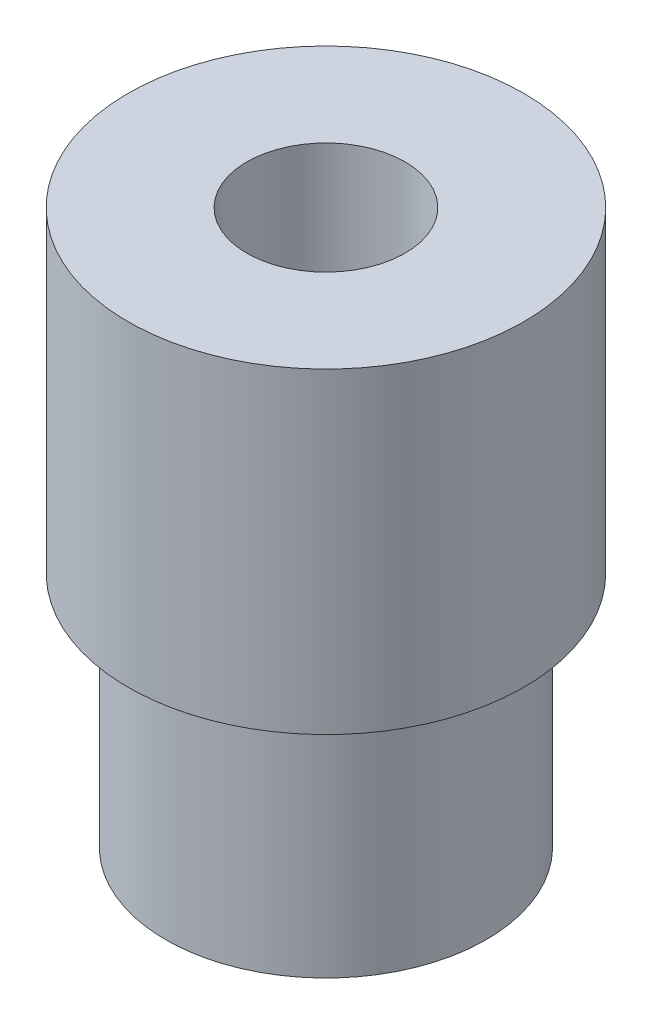
ISO-10303-21;
HEADER;
FILE_DESCRIPTION(('STEP AP214'),'2;1');
FILE_NAME('part.step','',(''),(''),'','','');
FILE_SCHEMA(('AUTOMOTIVE_DESIGN { 1 0 10303 214 1 1 1 1 }'));
ENDSEC;
DATA;
#1=APPLICATION_CONTEXT('core data for automotive mechanical design processes');
#2=APPLICATION_PROTOCOL_DEFINITION('international standard','automotive_design',2000,#1);
#3=PRODUCT_CONTEXT('',#1,'mechanical');
#4=PRODUCT('Part','Part','',(#3));
#5=PRODUCT_RELATED_PRODUCT_CATEGORY('part','',(#4));
#6=PRODUCT_DEFINITION_FORMATION('','',#4);
#7=PRODUCT_DEFINITION_CONTEXT('part definition',#1,'design');
#8=PRODUCT_DEFINITION('design','',#6,#7);
#9=PRODUCT_DEFINITION_SHAPE('','',#8);
#10=(LENGTH_UNIT() NAMED_UNIT(*) SI_UNIT(.MILLI.,.METRE.));
#11=(NAMED_UNIT(*) PLANE_ANGLE_UNIT() SI_UNIT($,.RADIAN.));
#12=(NAMED_UNIT(*) SI_UNIT($,.STERADIAN.) SOLID_ANGLE_UNIT());
#13=UNCERTAINTY_MEASURE_WITH_UNIT(LENGTH_MEASURE(1.E-05),#10,'distance_accuracy_value','');
#14=(GEOMETRIC_REPRESENTATION_CONTEXT(3) GLOBAL_UNCERTAINTY_ASSIGNED_CONTEXT((#13)) GLOBAL_UNIT_ASSIGNED_CONTEXT((#10,
#11,#12)) REPRESENTATION_CONTEXT('',''));
#15=CARTESIAN_POINT('',(0.,0.,0.));
#16=DIRECTION('',(0.,0.,1.));
#17=DIRECTION('',(1.,0.,0.));
#18=AXIS2_PLACEMENT_3D('',#15,#16,#17);
#19=CARTESIAN_POINT('',(0.,0.,0.));
#20=DIRECTION('',(0.,-1.,0.));
#21=DIRECTION('',(0.,0.,-1.));
#22=AXIS2_PLACEMENT_3D('',#19,#20,#21);
#23=CYLINDRICAL_SURFACE('',#22,5.);
#24=CARTESIAN_POINT('',(0.,14.,0.));
#25=DIRECTION('',(0.,-1.,0.));
#26=DIRECTION('',(0.,0.,-1.));
#27=AXIS2_PLACEMENT_3D('',#24,#25,#26);
#28=CIRCLE('',#27,5.);
#29=CARTESIAN_POINT('',(0.,14.,-5.));
#30=VERTEX_POINT('',#29);
#31=EDGE_CURVE('E52',#30,#30,#28,.T.);
#32=ORIENTED_EDGE('',*,*,#31,.T.);
#33=EDGE_LOOP('',(#32));
#34=FACE_BOUND('',#33,.T.);
#35=CARTESIAN_POINT('',(0.,6.,0.));
#36=DIRECTION('',(0.,-1.,0.));
#37=DIRECTION('',(0.,0.,-1.));
#38=AXIS2_PLACEMENT_3D('',#35,#36,#37);
#39=CIRCLE('',#38,5.);
#40=CARTESIAN_POINT('',(0.,6.,-5.));
#41=VERTEX_POINT('',#40);
#42=EDGE_CURVE('E10',#41,#41,#39,.T.);
#43=ORIENTED_EDGE('',*,*,#42,.F.);
#44=EDGE_LOOP('',(#43));
#45=FACE_BOUND('',#44,.T.);
#46=ADVANCED_FACE('F30',(#34,#45),#23,.T.);
#47=CARTESIAN_POINT('',(5.,6.,0.));
#48=DIRECTION('',(0.,-1.,0.));
#49=DIRECTION('',(0.,0.,-1.));
#50=AXIS2_PLACEMENT_3D('',#47,#48,#49);
#51=PLANE('',#50);
#52=ORIENTED_EDGE('',*,*,#42,.T.);
#53=EDGE_LOOP('',(#52));
#54=FACE_BOUND('',#53,.T.);
#55=CARTESIAN_POINT('',(0.,6.,0.));
#56=DIRECTION('',(0.,-1.,0.));
#57=DIRECTION('',(0.,0.,-1.));
#58=AXIS2_PLACEMENT_3D('',#55,#56,#57);
#59=CIRCLE('',#58,4.05);
#60=CARTESIAN_POINT('',(0.,6.,-4.05));
#61=VERTEX_POINT('',#60);
#62=EDGE_CURVE('E36',#61,#61,#59,.T.);
#63=ORIENTED_EDGE('',*,*,#62,.F.);
#64=EDGE_LOOP('',(#63));
#65=FACE_BOUND('',#64,.T.);
#66=ADVANCED_FACE('F70',(#54,#65),#51,.T.);
#67=CARTESIAN_POINT('',(0.,0.,0.));
#68=DIRECTION('',(0.,-1.,0.));
#69=DIRECTION('',(0.,0.,-1.));
#70=AXIS2_PLACEMENT_3D('',#67,#68,#69);
#71=CYLINDRICAL_SURFACE('',#70,4.05);
#72=ORIENTED_EDGE('',*,*,#62,.T.);
#73=EDGE_LOOP('',(#72));
#74=FACE_BOUND('',#73,.T.);
#75=CARTESIAN_POINT('',(0.,0.,0.));
#76=DIRECTION('',(0.,-1.,0.));
#77=DIRECTION('',(0.,0.,-1.));
#78=AXIS2_PLACEMENT_3D('',#75,#76,#77);
#79=CIRCLE('',#78,4.05);
#80=CARTESIAN_POINT('',(0.,0.,-4.05));
#81=VERTEX_POINT('',#80);
#82=EDGE_CURVE('E40',#81,#81,#79,.T.);
#83=ORIENTED_EDGE('',*,*,#82,.F.);
#84=EDGE_LOOP('',(#83));
#85=FACE_BOUND('',#84,.T.);
#86=ADVANCED_FACE('F74',(#74,#85),#71,.T.);
#87=CARTESIAN_POINT('',(4.05,0.,0.));
#88=DIRECTION('',(0.,-1.,0.));
#89=DIRECTION('',(0.,0.,-1.));
#90=AXIS2_PLACEMENT_3D('',#87,#88,#89);
#91=PLANE('',#90);
#92=ORIENTED_EDGE('',*,*,#82,.T.);
#93=EDGE_LOOP('',(#92));
#94=FACE_BOUND('',#93,.T.);
#95=CARTESIAN_POINT('',(0.,0.,0.));
#96=DIRECTION('',(0.,-1.,0.));
#97=DIRECTION('',(0.,0.,-1.));
#98=AXIS2_PLACEMENT_3D('',#95,#96,#97);
#99=CIRCLE('',#98,2.);
#100=CARTESIAN_POINT('',(0.,0.,-2.));
#101=VERTEX_POINT('',#100);
#102=EDGE_CURVE('E44',#101,#101,#99,.T.);
#103=ORIENTED_EDGE('',*,*,#102,.F.);
#104=EDGE_LOOP('',(#103));
#105=FACE_BOUND('',#104,.T.);
#106=ADVANCED_FACE('F66',(#94,#105),#91,.T.);
#107=CARTESIAN_POINT('',(0.,0.,0.));
#108=DIRECTION('',(0.,-1.,0.));
#109=DIRECTION('',(0.,0.,-1.));
#110=AXIS2_PLACEMENT_3D('',#107,#108,#109);
#111=CYLINDRICAL_SURFACE('',#110,2.);
#112=ORIENTED_EDGE('',*,*,#102,.T.);
#113=EDGE_LOOP('',(#112));
#114=FACE_BOUND('',#113,.T.);
#115=CARTESIAN_POINT('',(0.,14.,0.));
#116=DIRECTION('',(0.,-1.,0.));
#117=DIRECTION('',(0.,0.,-1.));
#118=AXIS2_PLACEMENT_3D('',#115,#116,#117);
#119=CIRCLE('',#118,2.);
#120=CARTESIAN_POINT('',(0.,14.,-2.));
#121=VERTEX_POINT('',#120);
#122=EDGE_CURVE('E49',#121,#121,#119,.T.);
#123=ORIENTED_EDGE('',*,*,#122,.F.);
#124=EDGE_LOOP('',(#123));
#125=FACE_BOUND('',#124,.T.);
#126=ADVANCED_FACE('F60',(#114,#125),#111,.F.);
#127=CARTESIAN_POINT('',(2.,14.,0.));
#128=DIRECTION('',(0.,1.,0.));
#129=DIRECTION('',(0.,0.,1.));
#130=AXIS2_PLACEMENT_3D('',#127,#128,#129);
#131=PLANE('',#130);
#132=ORIENTED_EDGE('',*,*,#122,.T.);
#133=EDGE_LOOP('',(#132));
#134=FACE_BOUND('',#133,.T.);
#135=ORIENTED_EDGE('',*,*,#31,.F.);
#136=EDGE_LOOP('',(#135));
#137=FACE_BOUND('',#136,.T.);
#138=ADVANCED_FACE('F58',(#134,#137),#131,.T.);
#139=CLOSED_SHELL('',(#46,#66,#86,#106,#126,#138));
#140=MANIFOLD_SOLID_BREP('B2',#139);
#141=ADVANCED_BREP_SHAPE_REPRESENTATION('',(#18,#140),#14);
#142=SHAPE_DEFINITION_REPRESENTATION(#9,#141);
ENDSEC;
END-ISO-10303-21;
